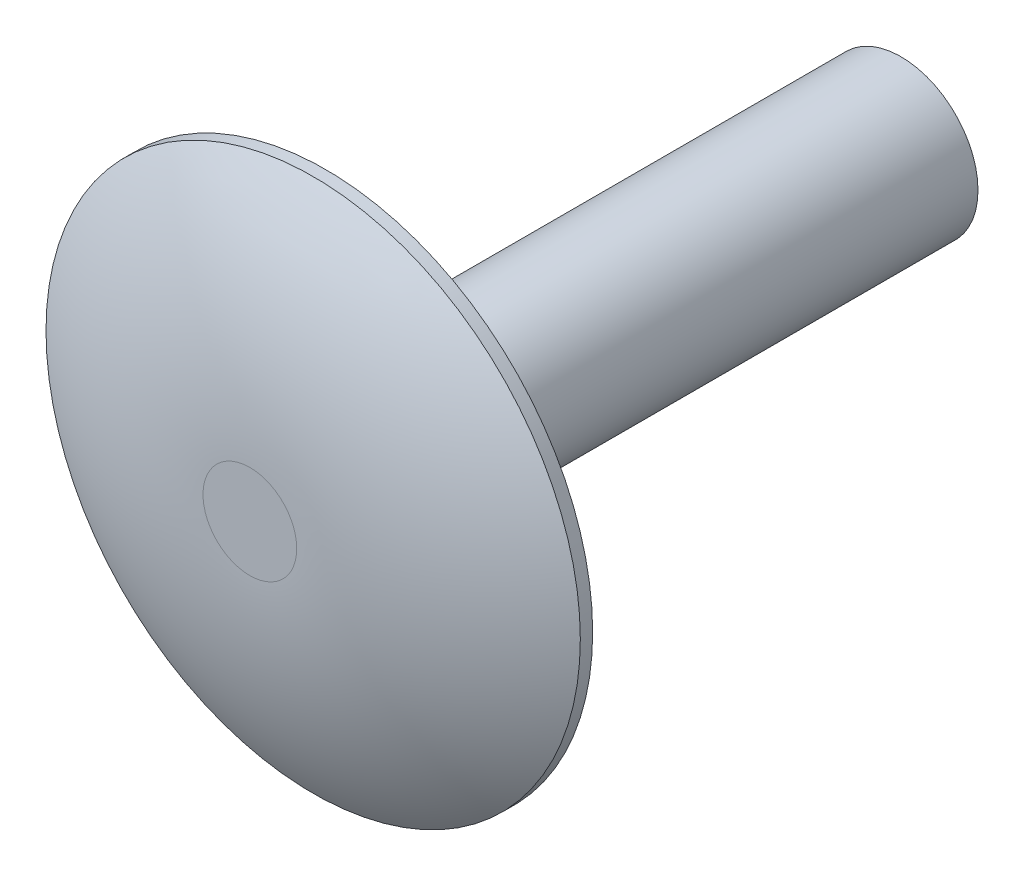
ISO-10303-21;
HEADER;
FILE_DESCRIPTION(('STEP AP214'),'2;1');
FILE_NAME('part.step','',(''),(''),'','','');
FILE_SCHEMA(('AUTOMOTIVE_DESIGN { 1 0 10303 214 1 1 1 1 }'));
ENDSEC;
DATA;
#1=APPLICATION_CONTEXT('core data for automotive mechanical design processes');
#2=APPLICATION_PROTOCOL_DEFINITION('international standard','automotive_design',2000,#1);
#3=PRODUCT_CONTEXT('',#1,'mechanical');
#4=PRODUCT('Part','Part','',(#3));
#5=PRODUCT_RELATED_PRODUCT_CATEGORY('part','',(#4));
#6=PRODUCT_DEFINITION_FORMATION('','',#4);
#7=PRODUCT_DEFINITION_CONTEXT('part definition',#1,'design');
#8=PRODUCT_DEFINITION('design','',#6,#7);
#9=PRODUCT_DEFINITION_SHAPE('','',#8);
#10=(LENGTH_UNIT() NAMED_UNIT(*) SI_UNIT(.MILLI.,.METRE.));
#11=(NAMED_UNIT(*) PLANE_ANGLE_UNIT() SI_UNIT($,.RADIAN.));
#12=(NAMED_UNIT(*) SI_UNIT($,.STERADIAN.) SOLID_ANGLE_UNIT());
#13=UNCERTAINTY_MEASURE_WITH_UNIT(LENGTH_MEASURE(1.E-05),#10,'distance_accuracy_value','');
#14=(GEOMETRIC_REPRESENTATION_CONTEXT(3) GLOBAL_UNCERTAINTY_ASSIGNED_CONTEXT((#13)) GLOBAL_UNIT_ASSIGNED_CONTEXT((#10,
#11,#12)) REPRESENTATION_CONTEXT('',''));
#15=CARTESIAN_POINT('',(0.,0.,0.));
#16=DIRECTION('',(0.,0.,1.));
#17=DIRECTION('',(1.,0.,0.));
#18=AXIS2_PLACEMENT_3D('',#15,#16,#17);
#19=CARTESIAN_POINT('',(0.,0.,2.3368));
#20=DIRECTION('',(0.,0.,-1.));
#21=DIRECTION('',(-1.,0.,0.));
#22=AXIS2_PLACEMENT_3D('',#19,#20,#21);
#23=CYLINDRICAL_SURFACE('',#22,8.255);
#24=CARTESIAN_POINT('',(0.,0.,0.));
#25=DIRECTION('',(0.,0.,1.));
#26=DIRECTION('',(1.,0.,0.));
#27=AXIS2_PLACEMENT_3D('',#24,#25,#26);
#28=CIRCLE('',#27,8.255);
#29=CARTESIAN_POINT('',(8.255,0.,0.));
#30=VERTEX_POINT('',#29);
#31=EDGE_CURVE('E10',#30,#30,#28,.T.);
#32=ORIENTED_EDGE('',*,*,#31,.T.);
#33=EDGE_LOOP('',(#32));
#34=FACE_BOUND('',#33,.T.);
#35=CARTESIAN_POINT('',(0.,0.,0.381));
#36=DIRECTION('',(0.,0.,1.));
#37=DIRECTION('',(1.,0.,0.));
#38=AXIS2_PLACEMENT_3D('',#35,#36,#37);
#39=CIRCLE('',#38,8.255);
#40=CARTESIAN_POINT('',(8.255,0.,0.381));
#41=VERTEX_POINT('',#40);
#42=EDGE_CURVE('E51',#41,#41,#39,.T.);
#43=ORIENTED_EDGE('',*,*,#42,.F.);
#44=EDGE_LOOP('',(#43));
#45=FACE_BOUND('',#44,.T.);
#46=ADVANCED_FACE('F32',(#34,#45),#23,.T.);
#47=CARTESIAN_POINT('',(0.,0.,0.));
#48=DIRECTION('',(0.,0.,1.));
#49=DIRECTION('',(1.,0.,0.));
#50=AXIS2_PLACEMENT_3D('',#47,#48,#49);
#51=PLANE('',#50);
#52=CARTESIAN_POINT('',(0.,0.,0.));
#53=DIRECTION('',(0.,0.,1.));
#54=DIRECTION('',(1.,0.,0.));
#55=AXIS2_PLACEMENT_3D('',#52,#53,#54);
#56=CIRCLE('',#55,2.38125);
#57=CARTESIAN_POINT('',(2.38125,0.,0.));
#58=VERTEX_POINT('',#57);
#59=EDGE_CURVE('E42',#58,#58,#56,.T.);
#60=ORIENTED_EDGE('',*,*,#59,.T.);
#61=EDGE_LOOP('',(#60));
#62=FACE_BOUND('',#61,.T.);
#63=ORIENTED_EDGE('',*,*,#31,.F.);
#64=EDGE_LOOP('',(#63));
#65=FACE_BOUND('',#64,.T.);
#66=ADVANCED_FACE('F59',(#62,#65),#51,.F.);
#67=CARTESIAN_POINT('',(0.,0.,-17.78));
#68=DIRECTION('',(0.,0.,1.));
#69=DIRECTION('',(1.,0.,0.));
#70=AXIS2_PLACEMENT_3D('',#67,#68,#69);
#71=CYLINDRICAL_SURFACE('',#70,2.38125);
#72=CARTESIAN_POINT('',(0.,0.,-17.78));
#73=DIRECTION('',(0.,0.,1.));
#74=DIRECTION('',(1.,0.,0.));
#75=AXIS2_PLACEMENT_3D('',#72,#73,#74);
#76=CIRCLE('',#75,2.38125);
#77=CARTESIAN_POINT('',(2.38125,0.,-17.78));
#78=VERTEX_POINT('',#77);
#79=EDGE_CURVE('E38',#78,#78,#76,.T.);
#80=ORIENTED_EDGE('',*,*,#79,.T.);
#81=EDGE_LOOP('',(#80));
#82=FACE_BOUND('',#81,.T.);
#83=ORIENTED_EDGE('',*,*,#59,.F.);
#84=EDGE_LOOP('',(#83));
#85=FACE_BOUND('',#84,.T.);
#86=ADVANCED_FACE('F63',(#82,#85),#71,.T.);
#87=CARTESIAN_POINT('',(0.,0.,-17.78));
#88=DIRECTION('',(0.,0.,1.));
#89=DIRECTION('',(1.,0.,0.));
#90=AXIS2_PLACEMENT_3D('',#87,#88,#89);
#91=PLANE('',#90);
#92=ORIENTED_EDGE('',*,*,#79,.F.);
#93=EDGE_LOOP('',(#92));
#94=FACE_BOUND('',#93,.T.);
#95=ADVANCED_FACE('F68',(#94),#91,.F.);
#96=CARTESIAN_POINT('',(0.,0.,-10.4873961038961));
#97=DIRECTION('',(0.,0.,1.));
#98=DIRECTION('',(1.,0.,0.));
#99=AXIS2_PLACEMENT_3D('',#96,#97,#98);
#100=DEGENERATE_TOROIDAL_SURFACE('',#99,1.4478,12.8241961038961,.T.);
#101=ORIENTED_EDGE('',*,*,#42,.T.);
#102=EDGE_LOOP('',(#101));
#103=FACE_BOUND('',#102,.T.);
#104=CARTESIAN_POINT('',(0.,0.,2.3368));
#105=DIRECTION('',(0.,0.,1.));
#106=DIRECTION('',(1.,0.,0.));
#107=AXIS2_PLACEMENT_3D('',#104,#105,#106);
#108=CIRCLE('',#107,1.4478);
#109=CARTESIAN_POINT('',(1.4478,0.,2.3368));
#110=VERTEX_POINT('',#109);
#111=EDGE_CURVE('E47',#110,#110,#108,.T.);
#112=ORIENTED_EDGE('',*,*,#111,.F.);
#113=EDGE_LOOP('',(#112));
#114=FACE_BOUND('',#113,.T.);
#115=ADVANCED_FACE('F55',(#103,#114),#100,.T.);
#116=CARTESIAN_POINT('',(0.,0.,2.3368));
#117=DIRECTION('',(0.,0.,1.));
#118=DIRECTION('',(1.,0.,0.));
#119=AXIS2_PLACEMENT_3D('',#116,#117,#118);
#120=PLANE('',#119);
#121=ORIENTED_EDGE('',*,*,#111,.T.);
#122=EDGE_LOOP('',(#121));
#123=FACE_BOUND('',#122,.T.);
#124=ADVANCED_FACE('F72',(#123),#120,.T.);
#125=CLOSED_SHELL('',(#46,#66,#86,#95,#115,#124));
#126=MANIFOLD_SOLID_BREP('B2',#125);
#127=ADVANCED_BREP_SHAPE_REPRESENTATION('',(#18,#126),#14);
#128=SHAPE_DEFINITION_REPRESENTATION(#9,#127);
ENDSEC;
END-ISO-10303-21;
